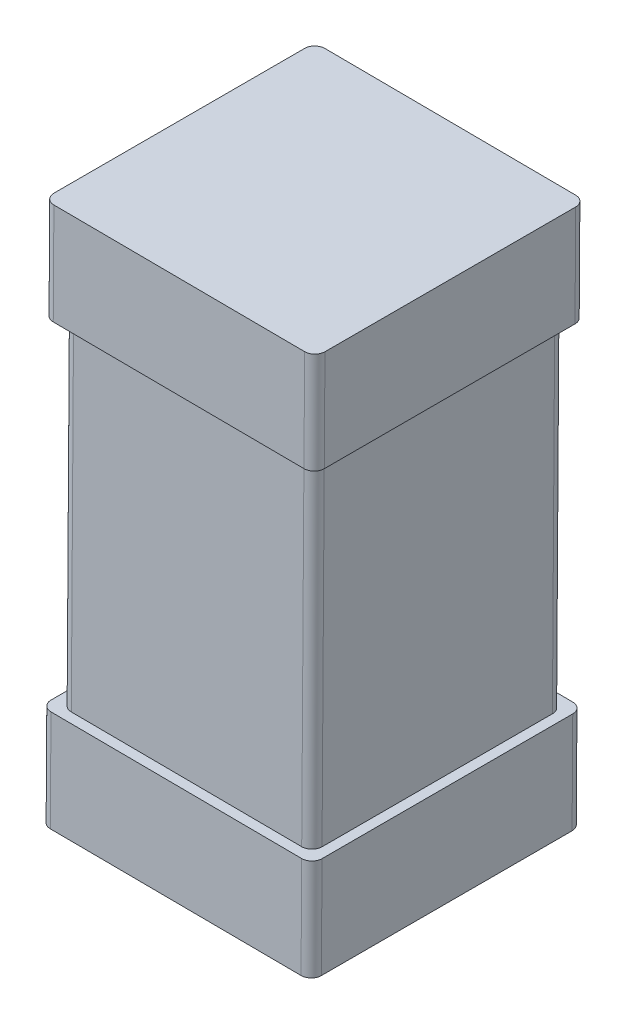
ISO-10303-21;
HEADER;
FILE_DESCRIPTION(('STEP AP214'),'2;1');
FILE_NAME('part.step','',(''),(''),'','','');
FILE_SCHEMA(('AUTOMOTIVE_DESIGN { 1 0 10303 214 1 1 1 1 }'));
ENDSEC;
DATA;
#1=APPLICATION_CONTEXT('core data for automotive mechanical design processes');
#2=APPLICATION_PROTOCOL_DEFINITION('international standard','automotive_design',2000,#1);
#3=PRODUCT_CONTEXT('',#1,'mechanical');
#4=PRODUCT('Part','Part','',(#3));
#5=PRODUCT_RELATED_PRODUCT_CATEGORY('part','',(#4));
#6=PRODUCT_DEFINITION_FORMATION('','',#4);
#7=PRODUCT_DEFINITION_CONTEXT('part definition',#1,'design');
#8=PRODUCT_DEFINITION('design','',#6,#7);
#9=PRODUCT_DEFINITION_SHAPE('','',#8);
#10=(LENGTH_UNIT() NAMED_UNIT(*) SI_UNIT(.MILLI.,.METRE.));
#11=(NAMED_UNIT(*) PLANE_ANGLE_UNIT() SI_UNIT($,.RADIAN.));
#12=(NAMED_UNIT(*) SI_UNIT($,.STERADIAN.) SOLID_ANGLE_UNIT());
#13=UNCERTAINTY_MEASURE_WITH_UNIT(LENGTH_MEASURE(1.E-05),#10,'distance_accuracy_value','');
#14=(GEOMETRIC_REPRESENTATION_CONTEXT(3) GLOBAL_UNCERTAINTY_ASSIGNED_CONTEXT((#13)) GLOBAL_UNIT_ASSIGNED_CONTEXT((#10,
#11,#12)) REPRESENTATION_CONTEXT('',''));
#15=CARTESIAN_POINT('',(0.,0.,0.));
#16=DIRECTION('',(0.,0.,1.));
#17=DIRECTION('',(1.,0.,0.));
#18=AXIS2_PLACEMENT_3D('',#15,#16,#17);
#19=CARTESIAN_POINT('',(219.024368827757,108.484397057099,142.211582908599));
#20=DIRECTION('',(-0.00663069374923689,-0.99997801670857,0.));
#21=DIRECTION('',(-0.99997801670857,0.00663069374923689,0.));
#22=AXIS2_PLACEMENT_3D('',#19,#20,#21);
#23=PLANE('',#22);
#24=DIRECTION('',(0.,0.,1.));
#25=VECTOR('',#24,1.);
#26=CARTESIAN_POINT('',(219.024368827757,108.484397057099,142.211582908599));
#27=LINE('',#26,#25);
#28=CARTESIAN_POINT('',(219.024368827757,108.484397057099,142.241582908599));
#29=VERTEX_POINT('',#28);
#30=CARTESIAN_POINT('',(219.024368827757,108.484397057099,142.981582908599));
#31=VERTEX_POINT('',#30);
#32=EDGE_CURVE('E67',#29,#31,#27,.T.);
#33=ORIENTED_EDGE('',*,*,#32,.F.);
#34=CARTESIAN_POINT('',(219.054368168258,108.484198136286,142.241582908599));
#35=DIRECTION('',(-0.00663069374923689,-0.99997801670857,0.));
#36=DIRECTION('',(0.,0.,1.));
#37=AXIS2_PLACEMENT_3D('',#34,#35,#36);
#38=CIRCLE('',#37,0.0300000000000023);
#39=CARTESIAN_POINT('',(219.054368168258,108.484198136286,142.211582908599));
#40=VERTEX_POINT('',#39);
#41=EDGE_CURVE('E11',#29,#40,#38,.T.);
#42=ORIENTED_EDGE('',*,*,#41,.T.);
#43=DIRECTION('',(0.999978016708569,-0.00663069374923689,0.));
#44=VECTOR('',#43,1.);
#45=CARTESIAN_POINT('',(219.024368827757,108.484397057099,142.211582908599));
#46=LINE('',#45,#44);
#47=CARTESIAN_POINT('',(219.794351900623,108.479291422912,142.211582908599));
#48=VERTEX_POINT('',#47);
#49=EDGE_CURVE('E55',#40,#48,#46,.T.);
#50=ORIENTED_EDGE('',*,*,#49,.T.);
#51=CARTESIAN_POINT('',(219.794351900623,108.479291422912,142.241582908599));
#52=DIRECTION('',(0.00663069374923689,0.99997801670857,0.));
#53=DIRECTION('',(0.,0.,1.));
#54=AXIS2_PLACEMENT_3D('',#51,#52,#53);
#55=CIRCLE('',#54,0.0300000000000023);
#56=CARTESIAN_POINT('',(219.824351241124,108.479092502099,142.241582908599));
#57=VERTEX_POINT('',#56);
#58=EDGE_CURVE('E340',#57,#48,#55,.T.);
#59=ORIENTED_EDGE('',*,*,#58,.F.);
#60=DIRECTION('',(0.,0.,1.));
#61=VECTOR('',#60,1.);
#62=CARTESIAN_POINT('',(219.824351241124,108.479092502099,142.211582908599));
#63=LINE('',#62,#61);
#64=CARTESIAN_POINT('',(219.824351241124,108.479092502099,142.981582908599));
#65=VERTEX_POINT('',#64);
#66=EDGE_CURVE('E418',#57,#65,#63,.T.);
#67=ORIENTED_EDGE('',*,*,#66,.T.);
#68=CARTESIAN_POINT('',(219.794351900623,108.479291422912,142.981582908599));
#69=DIRECTION('',(-0.00663069374923689,-0.99997801670857,0.));
#70=DIRECTION('',(0.,0.,1.));
#71=AXIS2_PLACEMENT_3D('',#68,#69,#70);
#72=CIRCLE('',#71,0.0300000000000023);
#73=CARTESIAN_POINT('',(219.794351900623,108.479291422912,143.011582908599));
#74=VERTEX_POINT('',#73);
#75=EDGE_CURVE('E295',#65,#74,#72,.T.);
#76=ORIENTED_EDGE('',*,*,#75,.T.);
#77=DIRECTION('',(0.999978016708569,-0.00663069374923689,0.));
#78=VECTOR('',#77,1.);
#79=CARTESIAN_POINT('',(219.024368827757,108.484397057099,143.011582908599));
#80=LINE('',#79,#78);
#81=CARTESIAN_POINT('',(219.054368168258,108.484198136286,143.011582908599));
#82=VERTEX_POINT('',#81);
#83=EDGE_CURVE('E297',#82,#74,#80,.T.);
#84=ORIENTED_EDGE('',*,*,#83,.F.);
#85=CARTESIAN_POINT('',(219.054368168258,108.484198136286,142.981582908599));
#86=DIRECTION('',(0.00663069374923689,0.99997801670857,0.));
#87=DIRECTION('',(0.,0.,1.));
#88=AXIS2_PLACEMENT_3D('',#85,#86,#87);
#89=CIRCLE('',#88,0.0300000000000023);
#90=EDGE_CURVE('E410',#31,#82,#89,.T.);
#91=ORIENTED_EDGE('',*,*,#90,.F.);
#92=EDGE_LOOP('',(#33,#42,#50,#59,#67,#76,#84,#91));
#93=FACE_BOUND('',#92,.T.);
#94=ADVANCED_FACE('F44',(#93),#23,.T.);
#95=CARTESIAN_POINT('',(219.826340449249,108.779085907112,142.211582908599));
#96=DIRECTION('',(0.99997801670857,-0.00663069374923689,0.));
#97=DIRECTION('',(0.,0.,-1.));
#98=AXIS2_PLACEMENT_3D('',#95,#96,#97);
#99=PLANE('',#98);
#100=ORIENTED_EDGE('',*,*,#66,.F.);
#101=DIRECTION('',(-0.00663069374923689,-0.999978016708569,0.));
#102=VECTOR('',#101,1.);
#103=CARTESIAN_POINT('',(219.826340449249,108.779085907112,142.241582908599));
#104=LINE('',#103,#102);
#105=CARTESIAN_POINT('',(219.826340449249,108.779085907112,142.241582908599));
#106=VERTEX_POINT('',#105);
#107=EDGE_CURVE('E368',#106,#57,#104,.T.);
#108=ORIENTED_EDGE('',*,*,#107,.F.);
#109=DIRECTION('',(0.,0.,1.));
#110=VECTOR('',#109,1.);
#111=CARTESIAN_POINT('',(219.826340449249,108.779085907112,142.211582908599));
#112=LINE('',#111,#110);
#113=CARTESIAN_POINT('',(219.826340449249,108.779085907112,142.981582908599));
#114=VERTEX_POINT('',#113);
#115=EDGE_CURVE('E291',#106,#114,#112,.T.);
#116=ORIENTED_EDGE('',*,*,#115,.T.);
#117=DIRECTION('',(-0.00663069374923689,-0.999978016708569,0.));
#118=VECTOR('',#117,1.);
#119=CARTESIAN_POINT('',(219.826340449249,108.779085907112,142.981582908599));
#120=LINE('',#119,#118);
#121=EDGE_CURVE('E296',#114,#65,#120,.T.);
#122=ORIENTED_EDGE('',*,*,#121,.T.);
#123=EDGE_LOOP('',(#100,#108,#116,#122));
#124=FACE_BOUND('',#123,.T.);
#125=ADVANCED_FACE('F703',(#124),#99,.T.);
#126=CARTESIAN_POINT('',(219.796341108748,108.779284827924,142.981582908599));
#127=DIRECTION('',(-0.00663069374915559,-0.99997801670857,0.));
#128=DIRECTION('',(0.99997801670857,-0.00663069374915559,0.));
#129=AXIS2_PLACEMENT_3D('',#126,#127,#128);
#130=CYLINDRICAL_SURFACE('',#129,0.0300000000000117);
#131=CARTESIAN_POINT('',(219.796341108748,108.779284827924,142.981582908599));
#132=DIRECTION('',(-0.00663069374923689,-0.99997801670857,0.));
#133=DIRECTION('',(0.,0.,1.));
#134=AXIS2_PLACEMENT_3D('',#131,#132,#133);
#135=CIRCLE('',#134,0.0300000000000023);
#136=CARTESIAN_POINT('',(219.796341108748,108.779284827924,143.011582908599));
#137=VERTEX_POINT('',#136);
#138=EDGE_CURVE('E355',#114,#137,#135,.T.);
#139=ORIENTED_EDGE('',*,*,#138,.T.);
#140=DIRECTION('',(-0.00663069374923689,-0.999978016708569,0.));
#141=VECTOR('',#140,1.);
#142=CARTESIAN_POINT('',(219.796341108748,108.779284827924,143.011582908599));
#143=LINE('',#142,#141);
#144=EDGE_CURVE('E364',#137,#74,#143,.T.);
#145=ORIENTED_EDGE('',*,*,#144,.T.);
#146=ORIENTED_EDGE('',*,*,#75,.F.);
#147=ORIENTED_EDGE('',*,*,#121,.F.);
#148=EDGE_LOOP('',(#139,#145,#146,#147));
#149=FACE_BOUND('',#148,.T.);
#150=ADVANCED_FACE('F397',(#149),#130,.T.);
#151=CARTESIAN_POINT('',(219.796341108748,108.779284827924,142.241582908599));
#152=DIRECTION('',(-0.00663069374915559,-0.99997801670857,0.));
#153=DIRECTION('',(0.99997801670857,-0.00663069374915559,0.));
#154=AXIS2_PLACEMENT_3D('',#151,#152,#153);
#155=CYLINDRICAL_SURFACE('',#154,0.0300000000000117);
#156=ORIENTED_EDGE('',*,*,#107,.T.);
#157=ORIENTED_EDGE('',*,*,#58,.T.);
#158=DIRECTION('',(-0.00663069374923689,-0.999978016708569,0.));
#159=VECTOR('',#158,1.);
#160=CARTESIAN_POINT('',(219.796341108748,108.779284827924,142.211582908599));
#161=LINE('',#160,#159);
#162=CARTESIAN_POINT('',(219.796341108748,108.779284827924,142.211582908599));
#163=VERTEX_POINT('',#162);
#164=EDGE_CURVE('E300',#163,#48,#161,.T.);
#165=ORIENTED_EDGE('',*,*,#164,.F.);
#166=CARTESIAN_POINT('',(219.796341108748,108.779284827924,142.241582908599));
#167=DIRECTION('',(0.00663069374923689,0.99997801670857,0.));
#168=DIRECTION('',(0.,0.,1.));
#169=AXIS2_PLACEMENT_3D('',#166,#167,#168);
#170=CIRCLE('',#169,0.0300000000000023);
#171=EDGE_CURVE('E279',#106,#163,#170,.T.);
#172=ORIENTED_EDGE('',*,*,#171,.F.);
#173=EDGE_LOOP('',(#156,#157,#165,#172));
#174=FACE_BOUND('',#173,.T.);
#175=ADVANCED_FACE('F648',(#174),#155,.T.);
#176=CARTESIAN_POINT('',(219.026358035881,108.784390462111,143.011582908599));
#177=DIRECTION('',(0.,0.,1.));
#178=DIRECTION('',(1.,0.,0.));
#179=AXIS2_PLACEMENT_3D('',#176,#177,#178);
#180=PLANE('',#179);
#181=DIRECTION('',(0.999978016708569,-0.00663069374923689,0.));
#182=VECTOR('',#181,1.);
#183=CARTESIAN_POINT('',(219.026358035881,108.784390462111,143.011582908599));
#184=LINE('',#183,#182);
#185=CARTESIAN_POINT('',(219.056357376383,108.784191541299,143.011582908599));
#186=VERTEX_POINT('',#185);
#187=EDGE_CURVE('E274',#186,#137,#184,.T.);
#188=ORIENTED_EDGE('',*,*,#187,.F.);
#189=DIRECTION('',(-0.00663069374923689,-0.999978016708569,0.));
#190=VECTOR('',#189,1.);
#191=CARTESIAN_POINT('',(219.056357376383,108.784191541299,143.011582908599));
#192=LINE('',#191,#190);
#193=EDGE_CURVE('E299',#186,#82,#192,.T.);
#194=ORIENTED_EDGE('',*,*,#193,.T.);
#195=ORIENTED_EDGE('',*,*,#83,.T.);
#196=ORIENTED_EDGE('',*,*,#144,.F.);
#197=EDGE_LOOP('',(#188,#194,#195,#196));
#198=FACE_BOUND('',#197,.T.);
#199=ADVANCED_FACE('F405',(#198),#180,.T.);
#200=CARTESIAN_POINT('',(219.026358035881,108.784390462111,142.211582908599));
#201=DIRECTION('',(0.,0.,1.));
#202=DIRECTION('',(1.,0.,0.));
#203=AXIS2_PLACEMENT_3D('',#200,#201,#202);
#204=PLANE('',#203);
#205=ORIENTED_EDGE('',*,*,#164,.T.);
#206=ORIENTED_EDGE('',*,*,#49,.F.);
#207=DIRECTION('',(-0.00663069374923689,-0.999978016708569,0.));
#208=VECTOR('',#207,1.);
#209=CARTESIAN_POINT('',(219.056357376383,108.784191541299,142.211582908599));
#210=LINE('',#209,#208);
#211=CARTESIAN_POINT('',(219.056357376383,108.784191541299,142.211582908599));
#212=VERTEX_POINT('',#211);
#213=EDGE_CURVE('E313',#212,#40,#210,.T.);
#214=ORIENTED_EDGE('',*,*,#213,.F.);
#215=DIRECTION('',(0.999978016708569,-0.00663069374923689,0.));
#216=VECTOR('',#215,1.);
#217=CARTESIAN_POINT('',(219.026358035881,108.784390462111,142.211582908599));
#218=LINE('',#217,#216);
#219=EDGE_CURVE('E358',#212,#163,#218,.T.);
#220=ORIENTED_EDGE('',*,*,#219,.T.);
#221=EDGE_LOOP('',(#205,#206,#214,#220));
#222=FACE_BOUND('',#221,.T.);
#223=ADVANCED_FACE('F581',(#222),#204,.F.);
#224=CARTESIAN_POINT('',(219.056357376383,108.784191541299,142.981582908599));
#225=DIRECTION('',(-0.00663069374915559,-0.99997801670857,0.));
#226=DIRECTION('',(-0.99997801670857,0.00663069374915559,0.));
#227=AXIS2_PLACEMENT_3D('',#224,#225,#226);
#228=CYLINDRICAL_SURFACE('',#227,0.0300000000000117);
#229=DIRECTION('',(-0.00663069374923689,-0.999978016708569,0.));
#230=VECTOR('',#229,1.);
#231=CARTESIAN_POINT('',(219.026358035881,108.784390462111,142.981582908599));
#232=LINE('',#231,#230);
#233=CARTESIAN_POINT('',(219.026358035881,108.784390462111,142.981582908599));
#234=VERTEX_POINT('',#233);
#235=EDGE_CURVE('E412',#234,#31,#232,.T.);
#236=ORIENTED_EDGE('',*,*,#235,.T.);
#237=ORIENTED_EDGE('',*,*,#90,.T.);
#238=ORIENTED_EDGE('',*,*,#193,.F.);
#239=CARTESIAN_POINT('',(219.056357376383,108.784191541299,142.981582908599));
#240=DIRECTION('',(0.00663069374923689,0.99997801670857,0.));
#241=DIRECTION('',(0.,0.,1.));
#242=AXIS2_PLACEMENT_3D('',#239,#240,#241);
#243=CIRCLE('',#242,0.0300000000000023);
#244=EDGE_CURVE('E278',#234,#186,#243,.T.);
#245=ORIENTED_EDGE('',*,*,#244,.F.);
#246=EDGE_LOOP('',(#236,#237,#238,#245));
#247=FACE_BOUND('',#246,.T.);
#248=ADVANCED_FACE('F408',(#247),#228,.T.);
#249=CARTESIAN_POINT('',(219.056357376383,108.784191541299,142.241582908599));
#250=DIRECTION('',(-0.00663069374915559,-0.99997801670857,0.));
#251=DIRECTION('',(-0.99997801670857,0.00663069374915559,0.));
#252=AXIS2_PLACEMENT_3D('',#249,#250,#251);
#253=CYLINDRICAL_SURFACE('',#252,0.0300000000000117);
#254=CARTESIAN_POINT('',(219.056357376383,108.784191541299,142.241582908599));
#255=DIRECTION('',(-0.00663069374923689,-0.99997801670857,0.));
#256=DIRECTION('',(0.,0.,1.));
#257=AXIS2_PLACEMENT_3D('',#254,#255,#256);
#258=CIRCLE('',#257,0.0300000000000023);
#259=CARTESIAN_POINT('',(219.026358035881,108.784390462111,142.241582908599));
#260=VERTEX_POINT('',#259);
#261=EDGE_CURVE('E317',#260,#212,#258,.T.);
#262=ORIENTED_EDGE('',*,*,#261,.T.);
#263=ORIENTED_EDGE('',*,*,#213,.T.);
#264=ORIENTED_EDGE('',*,*,#41,.F.);
#265=DIRECTION('',(-0.00663069374923689,-0.999978016708569,0.));
#266=VECTOR('',#265,1.);
#267=CARTESIAN_POINT('',(219.026358035881,108.784390462111,142.241582908599));
#268=LINE('',#267,#266);
#269=EDGE_CURVE('E318',#260,#29,#268,.T.);
#270=ORIENTED_EDGE('',*,*,#269,.F.);
#271=EDGE_LOOP('',(#262,#263,#264,#270));
#272=FACE_BOUND('',#271,.T.);
#273=ADVANCED_FACE('F580',(#272),#253,.T.);
#274=CARTESIAN_POINT('',(219.026358035881,108.784390462111,142.211582908599));
#275=DIRECTION('',(0.99997801670857,-0.00663069374923689,0.));
#276=DIRECTION('',(0.,0.,-1.));
#277=AXIS2_PLACEMENT_3D('',#274,#275,#276);
#278=PLANE('',#277);
#279=ORIENTED_EDGE('',*,*,#235,.F.);
#280=DIRECTION('',(0.,0.,1.));
#281=VECTOR('',#280,1.);
#282=CARTESIAN_POINT('',(219.026358035881,108.784390462111,142.211582908599));
#283=LINE('',#282,#281);
#284=EDGE_CURVE('E341',#260,#234,#283,.T.);
#285=ORIENTED_EDGE('',*,*,#284,.F.);
#286=ORIENTED_EDGE('',*,*,#269,.T.);
#287=ORIENTED_EDGE('',*,*,#32,.T.);
#288=EDGE_LOOP('',(#279,#285,#286,#287));
#289=FACE_BOUND('',#288,.T.);
#290=ADVANCED_FACE('F752',(#289),#278,.F.);
#291=CARTESIAN_POINT('',(219.026358035881,108.784390462111,142.211582908599));
#292=DIRECTION('',(-0.00663069374923689,-0.99997801670857,0.));
#293=DIRECTION('',(-0.99997801670857,0.00663069374923689,0.));
#294=AXIS2_PLACEMENT_3D('',#291,#292,#293);
#295=PLANE('',#294);
#296=ORIENTED_EDGE('',*,*,#244,.T.);
#297=ORIENTED_EDGE('',*,*,#187,.T.);
#298=ORIENTED_EDGE('',*,*,#138,.F.);
#299=ORIENTED_EDGE('',*,*,#115,.F.);
#300=ORIENTED_EDGE('',*,*,#171,.T.);
#301=ORIENTED_EDGE('',*,*,#219,.F.);
#302=ORIENTED_EDGE('',*,*,#261,.F.);
#303=ORIENTED_EDGE('',*,*,#284,.T.);
#304=EDGE_LOOP('',(#296,#297,#298,#299,#300,#301,#302,#303));
#305=FACE_BOUND('',#304,.T.);
#306=DIRECTION('',(0.999978016708569,-0.00663069374923689,0.));
#307=VECTOR('',#306,1.);
#308=CARTESIAN_POINT('',(219.056357376383,108.784191541299,142.241582908599));
#309=LINE('',#308,#307);
#310=CARTESIAN_POINT('',(219.086356716884,108.783992620486,142.241582908599));
#311=VERTEX_POINT('',#310);
#312=CARTESIAN_POINT('',(219.766341768246,108.779483748737,142.241582908599));
#313=VERTEX_POINT('',#312);
#314=EDGE_CURVE('E345',#311,#313,#309,.T.);
#315=ORIENTED_EDGE('',*,*,#314,.T.);
#316=CARTESIAN_POINT('',(219.766341768246,108.779483748737,142.271582908599));
#317=DIRECTION('',(0.00663069374923689,0.99997801670857,0.));
#318=DIRECTION('',(0.,0.,1.));
#319=AXIS2_PLACEMENT_3D('',#316,#317,#318);
#320=CIRCLE('',#319,0.0300000000000023);
#321=CARTESIAN_POINT('',(219.796341108748,108.779284827924,142.271582908599));
#322=VERTEX_POINT('',#321);
#323=EDGE_CURVE('E241',#322,#313,#320,.T.);
#324=ORIENTED_EDGE('',*,*,#323,.F.);
#325=DIRECTION('',(0.,0.,1.));
#326=VECTOR('',#325,1.);
#327=CARTESIAN_POINT('',(219.796341108748,108.779284827924,142.241582908599));
#328=LINE('',#327,#326);
#329=CARTESIAN_POINT('',(219.796341108748,108.779284827924,142.951582908599));
#330=VERTEX_POINT('',#329);
#331=EDGE_CURVE('E236',#322,#330,#328,.T.);
#332=ORIENTED_EDGE('',*,*,#331,.T.);
#333=CARTESIAN_POINT('',(219.766341768246,108.779483748737,142.951582908599));
#334=DIRECTION('',(-0.00663069374923689,-0.99997801670857,0.));
#335=DIRECTION('',(0.,0.,1.));
#336=AXIS2_PLACEMENT_3D('',#333,#334,#335);
#337=CIRCLE('',#336,0.0300000000000023);
#338=CARTESIAN_POINT('',(219.766341768246,108.779483748737,142.981582908599));
#339=VERTEX_POINT('',#338);
#340=EDGE_CURVE('E464',#330,#339,#337,.T.);
#341=ORIENTED_EDGE('',*,*,#340,.T.);
#342=DIRECTION('',(0.999978016708569,-0.00663069374923689,0.));
#343=VECTOR('',#342,1.);
#344=CARTESIAN_POINT('',(219.056357376383,108.784191541299,142.981582908599));
#345=LINE('',#344,#343);
#346=CARTESIAN_POINT('',(219.086356716884,108.783992620486,142.981582908599));
#347=VERTEX_POINT('',#346);
#348=EDGE_CURVE('E312',#347,#339,#345,.T.);
#349=ORIENTED_EDGE('',*,*,#348,.F.);
#350=CARTESIAN_POINT('',(219.086356716884,108.783992620486,142.951582908599));
#351=DIRECTION('',(0.00663069374923689,0.99997801670857,0.));
#352=DIRECTION('',(0.,0.,1.));
#353=AXIS2_PLACEMENT_3D('',#350,#351,#352);
#354=CIRCLE('',#353,0.0300000000000023);
#355=CARTESIAN_POINT('',(219.056357376383,108.784191541299,142.951582908599));
#356=VERTEX_POINT('',#355);
#357=EDGE_CURVE('E311',#356,#347,#354,.T.);
#358=ORIENTED_EDGE('',*,*,#357,.F.);
#359=DIRECTION('',(0.,0.,1.));
#360=VECTOR('',#359,1.);
#361=CARTESIAN_POINT('',(219.056357376383,108.784191541299,142.241582908599));
#362=LINE('',#361,#360);
#363=CARTESIAN_POINT('',(219.056357376383,108.784191541299,142.271582908599));
#364=VERTEX_POINT('',#363);
#365=EDGE_CURVE('E445',#364,#356,#362,.T.);
#366=ORIENTED_EDGE('',*,*,#365,.F.);
#367=CARTESIAN_POINT('',(219.086356716884,108.783992620486,142.271582908599));
#368=DIRECTION('',(-0.00663069374923689,-0.99997801670857,0.));
#369=DIRECTION('',(0.,0.,1.));
#370=AXIS2_PLACEMENT_3D('',#367,#368,#369);
#371=CIRCLE('',#370,0.0300000000000023);
#372=EDGE_CURVE('E457',#364,#311,#371,.T.);
#373=ORIENTED_EDGE('',*,*,#372,.T.);
#374=EDGE_LOOP('',(#315,#324,#332,#341,#349,#358,#366,#373));
#375=FACE_BOUND('',#374,.T.);
#376=ADVANCED_FACE('F401',(#305,#375),#295,.F.);
#377=CARTESIAN_POINT('',(219.062988070132,109.784169558007,142.241582908599));
#378=DIRECTION('',(0.99997801670857,-0.00663069374923689,0.));
#379=DIRECTION('',(0.,0.,-1.));
#380=AXIS2_PLACEMENT_3D('',#377,#378,#379);
#381=PLANE('',#380);
#382=DIRECTION('',(-0.00663069374923689,-0.999978016708569,0.));
#383=VECTOR('',#382,1.);
#384=CARTESIAN_POINT('',(219.062988070132,109.784169558007,142.951582908599));
#385=LINE('',#384,#383);
#386=CARTESIAN_POINT('',(219.062988070132,109.784169558007,142.951582908599));
#387=VERTEX_POINT('',#386);
#388=EDGE_CURVE('E441',#387,#356,#385,.T.);
#389=ORIENTED_EDGE('',*,*,#388,.F.);
#390=DIRECTION('',(0.,0.,1.));
#391=VECTOR('',#390,1.);
#392=CARTESIAN_POINT('',(219.062988070132,109.784169558007,142.241582908599));
#393=LINE('',#392,#391);
#394=CARTESIAN_POINT('',(219.062988070132,109.784169558007,142.271582908599));
#395=VERTEX_POINT('',#394);
#396=EDGE_CURVE('E374',#395,#387,#393,.T.);
#397=ORIENTED_EDGE('',*,*,#396,.F.);
#398=DIRECTION('',(-0.00663069374923689,-0.999978016708569,0.));
#399=VECTOR('',#398,1.);
#400=CARTESIAN_POINT('',(219.062988070132,109.784169558007,142.271582908599));
#401=LINE('',#400,#399);
#402=EDGE_CURVE('E449',#395,#364,#401,.T.);
#403=ORIENTED_EDGE('',*,*,#402,.T.);
#404=ORIENTED_EDGE('',*,*,#365,.T.);
#405=EDGE_LOOP('',(#389,#397,#403,#404));
#406=FACE_BOUND('',#405,.T.);
#407=ADVANCED_FACE('F518',(#406),#381,.F.);
#408=CARTESIAN_POINT('',(219.092987410633,109.783970637195,142.951582908599));
#409=DIRECTION('',(-0.00663069374915559,-0.99997801670857,0.));
#410=DIRECTION('',(-0.99997801670857,0.00663069374915559,0.));
#411=AXIS2_PLACEMENT_3D('',#408,#409,#410);
#412=CYLINDRICAL_SURFACE('',#411,0.0300000000000117);
#413=ORIENTED_EDGE('',*,*,#388,.T.);
#414=ORIENTED_EDGE('',*,*,#357,.T.);
#415=DIRECTION('',(-0.00663069374923689,-0.999978016708569,0.));
#416=VECTOR('',#415,1.);
#417=CARTESIAN_POINT('',(219.092987410633,109.783970637195,142.981582908599));
#418=LINE('',#417,#416);
#419=CARTESIAN_POINT('',(219.092987410633,109.783970637195,142.981582908599));
#420=VERTEX_POINT('',#419);
#421=EDGE_CURVE('E307',#420,#347,#418,.T.);
#422=ORIENTED_EDGE('',*,*,#421,.F.);
#423=CARTESIAN_POINT('',(219.092987410633,109.783970637195,142.951582908599));
#424=DIRECTION('',(0.00663069374923689,0.99997801670857,0.));
#425=DIRECTION('',(0.,0.,1.));
#426=AXIS2_PLACEMENT_3D('',#423,#424,#425);
#427=CIRCLE('',#426,0.0300000000000023);
#428=EDGE_CURVE('E265',#387,#420,#427,.T.);
#429=ORIENTED_EDGE('',*,*,#428,.F.);
#430=EDGE_LOOP('',(#413,#414,#422,#429));
#431=FACE_BOUND('',#430,.T.);
#432=ADVANCED_FACE('F509',(#431),#412,.T.);
#433=CARTESIAN_POINT('',(219.062988070132,109.784169558007,142.981582908599));
#434=DIRECTION('',(0.,0.,1.));
#435=DIRECTION('',(1.,0.,0.));
#436=AXIS2_PLACEMENT_3D('',#433,#434,#435);
#437=PLANE('',#436);
#438=DIRECTION('',(0.999978016708569,-0.00663069374923689,0.));
#439=VECTOR('',#438,1.);
#440=CARTESIAN_POINT('',(219.062988070132,109.784169558007,142.981582908599));
#441=LINE('',#440,#439);
#442=CARTESIAN_POINT('',(219.772972461995,109.779461765445,142.981582908599));
#443=VERTEX_POINT('',#442);
#444=EDGE_CURVE('E259',#420,#443,#441,.T.);
#445=ORIENTED_EDGE('',*,*,#444,.F.);
#446=ORIENTED_EDGE('',*,*,#421,.T.);
#447=ORIENTED_EDGE('',*,*,#348,.T.);
#448=DIRECTION('',(-0.00663069374923689,-0.999978016708569,0.));
#449=VECTOR('',#448,1.);
#450=CARTESIAN_POINT('',(219.772972461995,109.779461765445,142.981582908599));
#451=LINE('',#450,#449);
#452=EDGE_CURVE('E252',#443,#339,#451,.T.);
#453=ORIENTED_EDGE('',*,*,#452,.F.);
#454=EDGE_LOOP('',(#445,#446,#447,#453));
#455=FACE_BOUND('',#454,.T.);
#456=ADVANCED_FACE('F514',(#455),#437,.T.);
#457=CARTESIAN_POINT('',(219.772972461995,109.779461765445,142.951582908599));
#458=DIRECTION('',(-0.00663069374915559,-0.99997801670857,0.));
#459=DIRECTION('',(0.99997801670857,-0.00663069374915559,0.));
#460=AXIS2_PLACEMENT_3D('',#457,#458,#459);
#461=CYLINDRICAL_SURFACE('',#460,0.0300000000000117);
#462=CARTESIAN_POINT('',(219.772972461995,109.779461765445,142.951582908599));
#463=DIRECTION('',(-0.00663069374923689,-0.99997801670857,0.));
#464=DIRECTION('',(0.,0.,1.));
#465=AXIS2_PLACEMENT_3D('',#462,#463,#464);
#466=CIRCLE('',#465,0.0300000000000023);
#467=CARTESIAN_POINT('',(219.802971802497,109.779262844633,142.951582908599));
#468=VERTEX_POINT('',#467);
#469=EDGE_CURVE('E48',#468,#443,#466,.T.);
#470=ORIENTED_EDGE('',*,*,#469,.T.);
#471=ORIENTED_EDGE('',*,*,#452,.T.);
#472=ORIENTED_EDGE('',*,*,#340,.F.);
#473=DIRECTION('',(-0.00663069374923689,-0.999978016708569,0.));
#474=VECTOR('',#473,1.);
#475=CARTESIAN_POINT('',(219.802971802497,109.779262844633,142.951582908599));
#476=LINE('',#475,#474);
#477=EDGE_CURVE('E240',#468,#330,#476,.T.);
#478=ORIENTED_EDGE('',*,*,#477,.F.);
#479=EDGE_LOOP('',(#470,#471,#472,#478));
#480=FACE_BOUND('',#479,.T.);
#481=ADVANCED_FACE('F570',(#480),#461,.T.);
#482=CARTESIAN_POINT('',(219.802971802497,109.779262844633,142.241582908599));
#483=DIRECTION('',(0.99997801670857,-0.00663069374923689,0.));
#484=DIRECTION('',(0.,0.,-1.));
#485=AXIS2_PLACEMENT_3D('',#482,#483,#484);
#486=PLANE('',#485);
#487=ORIENTED_EDGE('',*,*,#331,.F.);
#488=DIRECTION('',(-0.00663069374923689,-0.999978016708569,0.));
#489=VECTOR('',#488,1.);
#490=CARTESIAN_POINT('',(219.802971802497,109.779262844633,142.271582908599));
#491=LINE('',#490,#489);
#492=CARTESIAN_POINT('',(219.802971802497,109.779262844633,142.271582908599));
#493=VERTEX_POINT('',#492);
#494=EDGE_CURVE('E230',#493,#322,#491,.T.);
#495=ORIENTED_EDGE('',*,*,#494,.F.);
#496=DIRECTION('',(0.,0.,1.));
#497=VECTOR('',#496,1.);
#498=CARTESIAN_POINT('',(219.802971802497,109.779262844633,142.241582908599));
#499=LINE('',#498,#497);
#500=EDGE_CURVE('E234',#493,#468,#499,.T.);
#501=ORIENTED_EDGE('',*,*,#500,.T.);
#502=ORIENTED_EDGE('',*,*,#477,.T.);
#503=EDGE_LOOP('',(#487,#495,#501,#502));
#504=FACE_BOUND('',#503,.T.);
#505=ADVANCED_FACE('F232',(#504),#486,.T.);
#506=CARTESIAN_POINT('',(219.772972461995,109.779461765445,142.271582908599));
#507=DIRECTION('',(-0.00663069374915559,-0.99997801670857,0.));
#508=DIRECTION('',(0.99997801670857,-0.00663069374915559,0.));
#509=AXIS2_PLACEMENT_3D('',#506,#507,#508);
#510=CYLINDRICAL_SURFACE('',#509,0.0300000000000117);
#511=ORIENTED_EDGE('',*,*,#494,.T.);
#512=ORIENTED_EDGE('',*,*,#323,.T.);
#513=DIRECTION('',(-0.00663069374923689,-0.999978016708569,0.));
#514=VECTOR('',#513,1.);
#515=CARTESIAN_POINT('',(219.772972461995,109.779461765445,142.241582908599));
#516=LINE('',#515,#514);
#517=CARTESIAN_POINT('',(219.772972461995,109.779461765445,142.241582908599));
#518=VERTEX_POINT('',#517);
#519=EDGE_CURVE('E256',#518,#313,#516,.T.);
#520=ORIENTED_EDGE('',*,*,#519,.F.);
#521=CARTESIAN_POINT('',(219.772972461995,109.779461765445,142.271582908599));
#522=DIRECTION('',(0.00663069374923689,0.99997801670857,0.));
#523=DIRECTION('',(0.,0.,1.));
#524=AXIS2_PLACEMENT_3D('',#521,#522,#523);
#525=CIRCLE('',#524,0.0300000000000023);
#526=EDGE_CURVE('E248',#493,#518,#525,.T.);
#527=ORIENTED_EDGE('',*,*,#526,.F.);
#528=EDGE_LOOP('',(#511,#512,#520,#527));
#529=FACE_BOUND('',#528,.T.);
#530=ADVANCED_FACE('F254',(#529),#510,.T.);
#531=CARTESIAN_POINT('',(219.062988070132,109.784169558007,142.241582908599));
#532=DIRECTION('',(0.,0.,1.));
#533=DIRECTION('',(1.,0.,0.));
#534=AXIS2_PLACEMENT_3D('',#531,#532,#533);
#535=PLANE('',#534);
#536=ORIENTED_EDGE('',*,*,#519,.T.);
#537=ORIENTED_EDGE('',*,*,#314,.F.);
#538=DIRECTION('',(-0.00663069374923689,-0.999978016708569,0.));
#539=VECTOR('',#538,1.);
#540=CARTESIAN_POINT('',(219.092987410633,109.783970637195,142.241582908599));
#541=LINE('',#540,#539);
#542=CARTESIAN_POINT('',(219.092987410633,109.783970637195,142.241582908599));
#543=VERTEX_POINT('',#542);
#544=EDGE_CURVE('E331',#543,#311,#541,.T.);
#545=ORIENTED_EDGE('',*,*,#544,.F.);
#546=DIRECTION('',(0.999978016708569,-0.00663069374923689,0.));
#547=VECTOR('',#546,1.);
#548=CARTESIAN_POINT('',(219.062988070132,109.784169558007,142.241582908599));
#549=LINE('',#548,#547);
#550=EDGE_CURVE('E360',#543,#518,#549,.T.);
#551=ORIENTED_EDGE('',*,*,#550,.T.);
#552=EDGE_LOOP('',(#536,#537,#545,#551));
#553=FACE_BOUND('',#552,.T.);
#554=ADVANCED_FACE('F523',(#553),#535,.F.);
#555=CARTESIAN_POINT('',(219.092987410633,109.783970637195,142.271582908599));
#556=DIRECTION('',(-0.00663069374915559,-0.99997801670857,0.));
#557=DIRECTION('',(-0.99997801670857,0.00663069374915559,0.));
#558=AXIS2_PLACEMENT_3D('',#555,#556,#557);
#559=CYLINDRICAL_SURFACE('',#558,0.0300000000000117);
#560=CARTESIAN_POINT('',(219.092987410633,109.783970637195,142.271582908599));
#561=DIRECTION('',(-0.00663069374923689,-0.99997801670857,0.));
#562=DIRECTION('',(0.,0.,1.));
#563=AXIS2_PLACEMENT_3D('',#560,#561,#562);
#564=CIRCLE('',#563,0.0300000000000023);
#565=EDGE_CURVE('E363',#395,#543,#564,.T.);
#566=ORIENTED_EDGE('',*,*,#565,.T.);
#567=ORIENTED_EDGE('',*,*,#544,.T.);
#568=ORIENTED_EDGE('',*,*,#372,.F.);
#569=ORIENTED_EDGE('',*,*,#402,.F.);
#570=EDGE_LOOP('',(#566,#567,#568,#569));
#571=FACE_BOUND('',#570,.T.);
#572=ADVANCED_FACE('F46',(#571),#559,.T.);
#573=CARTESIAN_POINT('',(219.032988729631,109.78436847882,142.211582908599));
#574=DIRECTION('',(-0.00663069374923689,-0.99997801670857,0.));
#575=DIRECTION('',(-0.99997801670857,0.00663069374923689,0.));
#576=AXIS2_PLACEMENT_3D('',#573,#574,#575);
#577=PLANE('',#576);
#578=DIRECTION('',(0.,0.,1.));
#579=VECTOR('',#578,1.);
#580=CARTESIAN_POINT('',(219.032988729631,109.78436847882,142.211582908599));
#581=LINE('',#580,#579);
#582=CARTESIAN_POINT('',(219.032988729631,109.78436847882,142.241582908599));
#583=VERTEX_POINT('',#582);
#584=CARTESIAN_POINT('',(219.032988729631,109.78436847882,142.981582908599));
#585=VERTEX_POINT('',#584);
#586=EDGE_CURVE('E375',#583,#585,#581,.T.);
#587=ORIENTED_EDGE('',*,*,#586,.F.);
#588=CARTESIAN_POINT('',(219.062988070132,109.784169558007,142.241582908599));
#589=DIRECTION('',(-0.00663069374923689,-0.99997801670857,0.));
#590=DIRECTION('',(0.,0.,1.));
#591=AXIS2_PLACEMENT_3D('',#588,#589,#590);
#592=CIRCLE('',#591,0.0300000000000023);
#593=CARTESIAN_POINT('',(219.062988070132,109.784169558007,142.211582908599));
#594=VERTEX_POINT('',#593);
#595=EDGE_CURVE('E327',#583,#594,#592,.T.);
#596=ORIENTED_EDGE('',*,*,#595,.T.);
#597=DIRECTION('',(0.999978016708569,-0.00663069374923689,0.));
#598=VECTOR('',#597,1.);
#599=CARTESIAN_POINT('',(219.032988729631,109.78436847882,142.211582908599));
#600=LINE('',#599,#598);
#601=CARTESIAN_POINT('',(219.802971802497,109.779262844633,142.211582908599));
#602=VERTEX_POINT('',#601);
#603=EDGE_CURVE('E332',#594,#602,#600,.T.);
#604=ORIENTED_EDGE('',*,*,#603,.T.);
#605=CARTESIAN_POINT('',(219.802971802497,109.779262844633,142.241582908599));
#606=DIRECTION('',(0.00663069374923689,0.99997801670857,0.));
#607=DIRECTION('',(0.,0.,1.));
#608=AXIS2_PLACEMENT_3D('',#605,#606,#607);
#609=CIRCLE('',#608,0.0300000000000023);
#610=CARTESIAN_POINT('',(219.832971142997,109.77906392382,142.241582908599));
#611=VERTEX_POINT('',#610);
#612=EDGE_CURVE('E323',#611,#602,#609,.T.);
#613=ORIENTED_EDGE('',*,*,#612,.F.);
#614=DIRECTION('',(0.,0.,1.));
#615=VECTOR('',#614,1.);
#616=CARTESIAN_POINT('',(219.832971142997,109.77906392382,142.211582908599));
#617=LINE('',#616,#615);
#618=CARTESIAN_POINT('',(219.832971142997,109.77906392382,142.981582908599));
#619=VERTEX_POINT('',#618);
#620=EDGE_CURVE('E373',#611,#619,#617,.T.);
#621=ORIENTED_EDGE('',*,*,#620,.T.);
#622=CARTESIAN_POINT('',(219.802971802497,109.779262844633,142.981582908599));
#623=DIRECTION('',(-0.00663069374923689,-0.99997801670857,0.));
#624=DIRECTION('',(0.,0.,1.));
#625=AXIS2_PLACEMENT_3D('',#622,#623,#624);
#626=CIRCLE('',#625,0.0300000000000023);
#627=CARTESIAN_POINT('',(219.802971802497,109.779262844633,143.011582908599));
#628=VERTEX_POINT('',#627);
#629=EDGE_CURVE('E369',#619,#628,#626,.T.);
#630=ORIENTED_EDGE('',*,*,#629,.T.);
#631=DIRECTION('',(0.999978016708569,-0.00663069374923689,0.));
#632=VECTOR('',#631,1.);
#633=CARTESIAN_POINT('',(219.032988729631,109.78436847882,143.011582908599));
#634=LINE('',#633,#632);
#635=CARTESIAN_POINT('',(219.062988070132,109.784169558007,143.011582908599));
#636=VERTEX_POINT('',#635);
#637=EDGE_CURVE('E324',#636,#628,#634,.T.);
#638=ORIENTED_EDGE('',*,*,#637,.F.);
#639=CARTESIAN_POINT('',(219.062988070132,109.784169558007,142.981582908599));
#640=DIRECTION('',(0.00663069374923689,0.99997801670857,0.));
#641=DIRECTION('',(0.,0.,1.));
#642=AXIS2_PLACEMENT_3D('',#639,#640,#641);
#643=CIRCLE('',#642,0.0300000000000023);
#644=EDGE_CURVE('E289',#585,#636,#643,.T.);
#645=ORIENTED_EDGE('',*,*,#644,.F.);
#646=EDGE_LOOP('',(#587,#596,#604,#613,#621,#630,#638,#645));
#647=FACE_BOUND('',#646,.T.);
#648=ORIENTED_EDGE('',*,*,#565,.F.);
#649=ORIENTED_EDGE('',*,*,#396,.T.);
#650=ORIENTED_EDGE('',*,*,#428,.T.);
#651=ORIENTED_EDGE('',*,*,#444,.T.);
#652=ORIENTED_EDGE('',*,*,#469,.F.);
#653=ORIENTED_EDGE('',*,*,#500,.F.);
#654=ORIENTED_EDGE('',*,*,#526,.T.);
#655=ORIENTED_EDGE('',*,*,#550,.F.);
#656=EDGE_LOOP('',(#648,#649,#650,#651,#652,#653,#654,#655));
#657=FACE_BOUND('',#656,.T.);
#658=ADVANCED_FACE('F246',(#647,#657),#577,.T.);
#659=CARTESIAN_POINT('',(219.834960351122,110.079057328833,142.211582908599));
#660=DIRECTION('',(0.99997801670857,-0.00663069374923689,0.));
#661=DIRECTION('',(0.,0.,-1.));
#662=AXIS2_PLACEMENT_3D('',#659,#660,#661);
#663=PLANE('',#662);
#664=ORIENTED_EDGE('',*,*,#620,.F.);
#665=DIRECTION('',(-0.00663069374923689,-0.999978016708569,0.));
#666=VECTOR('',#665,1.);
#667=CARTESIAN_POINT('',(219.834960351122,110.079057328833,142.241582908599));
#668=LINE('',#667,#666);
#669=CARTESIAN_POINT('',(219.834960351122,110.079057328833,142.241582908599));
#670=VERTEX_POINT('',#669);
#671=EDGE_CURVE('E348',#670,#611,#668,.T.);
#672=ORIENTED_EDGE('',*,*,#671,.F.);
#673=DIRECTION('',(0.,0.,1.));
#674=VECTOR('',#673,1.);
#675=CARTESIAN_POINT('',(219.834960351122,110.079057328833,142.211582908599));
#676=LINE('',#675,#674);
#677=CARTESIAN_POINT('',(219.834960351122,110.079057328833,142.981582908599));
#678=VERTEX_POINT('',#677);
#679=EDGE_CURVE('E260',#670,#678,#676,.T.);
#680=ORIENTED_EDGE('',*,*,#679,.T.);
#681=DIRECTION('',(-0.00663069374923689,-0.999978016708569,0.));
#682=VECTOR('',#681,1.);
#683=CARTESIAN_POINT('',(219.834960351122,110.079057328833,142.981582908599));
#684=LINE('',#683,#682);
#685=EDGE_CURVE('E269',#678,#619,#684,.T.);
#686=ORIENTED_EDGE('',*,*,#685,.T.);
#687=EDGE_LOOP('',(#664,#672,#680,#686));
#688=FACE_BOUND('',#687,.T.);
#689=ADVANCED_FACE('F592',(#688),#663,.T.);
#690=CARTESIAN_POINT('',(219.804961010621,110.079256249646,142.981582908599));
#691=DIRECTION('',(-0.00663069374915559,-0.99997801670857,0.));
#692=DIRECTION('',(0.99997801670857,-0.00663069374915559,0.));
#693=AXIS2_PLACEMENT_3D('',#690,#691,#692);
#694=CYLINDRICAL_SURFACE('',#693,0.0300000000000117);
#695=CARTESIAN_POINT('',(219.804961010621,110.079256249646,142.981582908599));
#696=DIRECTION('',(-0.00663069374923689,-0.99997801670857,0.));
#697=DIRECTION('',(0.,0.,1.));
#698=AXIS2_PLACEMENT_3D('',#695,#696,#697);
#699=CIRCLE('',#698,0.0300000000000023);
#700=CARTESIAN_POINT('',(219.804961010621,110.079256249646,143.011582908599));
#701=VERTEX_POINT('',#700);
#702=EDGE_CURVE('E302',#678,#701,#699,.T.);
#703=ORIENTED_EDGE('',*,*,#702,.T.);
#704=DIRECTION('',(-0.00663069374923689,-0.999978016708569,0.));
#705=VECTOR('',#704,1.);
#706=CARTESIAN_POINT('',(219.804961010621,110.079256249646,143.011582908599));
#707=LINE('',#706,#705);
#708=EDGE_CURVE('E306',#701,#628,#707,.T.);
#709=ORIENTED_EDGE('',*,*,#708,.T.);
#710=ORIENTED_EDGE('',*,*,#629,.F.);
#711=ORIENTED_EDGE('',*,*,#685,.F.);
#712=EDGE_LOOP('',(#703,#709,#710,#711));
#713=FACE_BOUND('',#712,.T.);
#714=ADVANCED_FACE('F625',(#713),#694,.T.);
#715=CARTESIAN_POINT('',(219.804961010621,110.079256249646,142.241582908599));
#716=DIRECTION('',(-0.00663069374915559,-0.99997801670857,0.));
#717=DIRECTION('',(0.99997801670857,-0.00663069374915559,0.));
#718=AXIS2_PLACEMENT_3D('',#715,#716,#717);
#719=CYLINDRICAL_SURFACE('',#718,0.0300000000000117);
#720=ORIENTED_EDGE('',*,*,#671,.T.);
#721=ORIENTED_EDGE('',*,*,#612,.T.);
#722=DIRECTION('',(-0.00663069374923689,-0.999978016708569,0.));
#723=VECTOR('',#722,1.);
#724=CARTESIAN_POINT('',(219.804961010621,110.079256249646,142.211582908599));
#725=LINE('',#724,#723);
#726=CARTESIAN_POINT('',(219.804961010621,110.079256249646,142.211582908599));
#727=VERTEX_POINT('',#726);
#728=EDGE_CURVE('E430',#727,#602,#725,.T.);
#729=ORIENTED_EDGE('',*,*,#728,.F.);
#730=CARTESIAN_POINT('',(219.804961010621,110.079256249646,142.241582908599));
#731=DIRECTION('',(0.00663069374923689,0.99997801670857,0.));
#732=DIRECTION('',(0.,0.,1.));
#733=AXIS2_PLACEMENT_3D('',#730,#731,#732);
#734=CIRCLE('',#733,0.0300000000000023);
#735=EDGE_CURVE('E284',#670,#727,#734,.T.);
#736=ORIENTED_EDGE('',*,*,#735,.F.);
#737=EDGE_LOOP('',(#720,#721,#729,#736));
#738=FACE_BOUND('',#737,.T.);
#739=ADVANCED_FACE('F629',(#738),#719,.T.);
#740=CARTESIAN_POINT('',(219.034977937756,110.084361883832,143.011582908599));
#741=DIRECTION('',(0.,0.,1.));
#742=DIRECTION('',(1.,0.,0.));
#743=AXIS2_PLACEMENT_3D('',#740,#741,#742);
#744=PLANE('',#743);
#745=DIRECTION('',(0.999978016708569,-0.00663069374923689,0.));
#746=VECTOR('',#745,1.);
#747=CARTESIAN_POINT('',(219.034977937756,110.084361883832,143.011582908599));
#748=LINE('',#747,#746);
#749=CARTESIAN_POINT('',(219.064977278257,110.08416296302,143.011582908599));
#750=VERTEX_POINT('',#749);
#751=EDGE_CURVE('E385',#750,#701,#748,.T.);
#752=ORIENTED_EDGE('',*,*,#751,.F.);
#753=DIRECTION('',(-0.00663069374923689,-0.999978016708569,0.));
#754=VECTOR('',#753,1.);
#755=CARTESIAN_POINT('',(219.064977278257,110.08416296302,143.011582908599));
#756=LINE('',#755,#754);
#757=EDGE_CURVE('E319',#750,#636,#756,.T.);
#758=ORIENTED_EDGE('',*,*,#757,.T.);
#759=ORIENTED_EDGE('',*,*,#637,.T.);
#760=ORIENTED_EDGE('',*,*,#708,.F.);
#761=EDGE_LOOP('',(#752,#758,#759,#760));
#762=FACE_BOUND('',#761,.T.);
#763=ADVANCED_FACE('F740',(#762),#744,.T.);
#764=CARTESIAN_POINT('',(219.034977937756,110.084361883832,142.211582908599));
#765=DIRECTION('',(0.,0.,1.));
#766=DIRECTION('',(1.,0.,0.));
#767=AXIS2_PLACEMENT_3D('',#764,#765,#766);
#768=PLANE('',#767);
#769=ORIENTED_EDGE('',*,*,#728,.T.);
#770=ORIENTED_EDGE('',*,*,#603,.F.);
#771=DIRECTION('',(-0.00663069374923689,-0.999978016708569,0.));
#772=VECTOR('',#771,1.);
#773=CARTESIAN_POINT('',(219.064977278257,110.08416296302,142.211582908599));
#774=LINE('',#773,#772);
#775=CARTESIAN_POINT('',(219.064977278257,110.08416296302,142.211582908599));
#776=VERTEX_POINT('',#775);
#777=EDGE_CURVE('E290',#776,#594,#774,.T.);
#778=ORIENTED_EDGE('',*,*,#777,.F.);
#779=DIRECTION('',(0.999978016708569,-0.00663069374923689,0.));
#780=VECTOR('',#779,1.);
#781=CARTESIAN_POINT('',(219.034977937756,110.084361883832,142.211582908599));
#782=LINE('',#781,#780);
#783=EDGE_CURVE('E434',#776,#727,#782,.T.);
#784=ORIENTED_EDGE('',*,*,#783,.T.);
#785=EDGE_LOOP('',(#769,#770,#778,#784));
#786=FACE_BOUND('',#785,.T.);
#787=ADVANCED_FACE('F795',(#786),#768,.F.);
#788=CARTESIAN_POINT('',(219.064977278257,110.08416296302,142.981582908599));
#789=DIRECTION('',(-0.00663069374915559,-0.99997801670857,0.));
#790=DIRECTION('',(-0.99997801670857,0.00663069374915559,0.));
#791=AXIS2_PLACEMENT_3D('',#788,#789,#790);
#792=CYLINDRICAL_SURFACE('',#791,0.0300000000000117);
#793=DIRECTION('',(-0.00663069374923689,-0.999978016708569,0.));
#794=VECTOR('',#793,1.);
#795=CARTESIAN_POINT('',(219.034977937756,110.084361883832,142.981582908599));
#796=LINE('',#795,#794);
#797=CARTESIAN_POINT('',(219.034977937756,110.084361883832,142.981582908599));
#798=VERTEX_POINT('',#797);
#799=EDGE_CURVE('E388',#798,#585,#796,.T.);
#800=ORIENTED_EDGE('',*,*,#799,.T.);
#801=ORIENTED_EDGE('',*,*,#644,.T.);
#802=ORIENTED_EDGE('',*,*,#757,.F.);
#803=CARTESIAN_POINT('',(219.064977278257,110.08416296302,142.981582908599));
#804=DIRECTION('',(0.00663069374923689,0.99997801670857,0.));
#805=DIRECTION('',(0.,0.,1.));
#806=AXIS2_PLACEMENT_3D('',#803,#804,#805);
#807=CIRCLE('',#806,0.0300000000000023);
#808=EDGE_CURVE('E378',#798,#750,#807,.T.);
#809=ORIENTED_EDGE('',*,*,#808,.F.);
#810=EDGE_LOOP('',(#800,#801,#802,#809));
#811=FACE_BOUND('',#810,.T.);
#812=ADVANCED_FACE('F616',(#811),#792,.T.);
#813=CARTESIAN_POINT('',(219.064977278257,110.08416296302,142.241582908599));
#814=DIRECTION('',(-0.00663069374915559,-0.99997801670857,0.));
#815=DIRECTION('',(-0.99997801670857,0.00663069374915559,0.));
#816=AXIS2_PLACEMENT_3D('',#813,#814,#815);
#817=CYLINDRICAL_SURFACE('',#816,0.0300000000000117);
#818=CARTESIAN_POINT('',(219.064977278257,110.08416296302,142.241582908599));
#819=DIRECTION('',(-0.00663069374923689,-0.99997801670857,0.));
#820=DIRECTION('',(0.,0.,1.));
#821=AXIS2_PLACEMENT_3D('',#818,#819,#820);
#822=CIRCLE('',#821,0.0300000000000023);
#823=CARTESIAN_POINT('',(219.034977937756,110.084361883832,142.241582908599));
#824=VERTEX_POINT('',#823);
#825=EDGE_CURVE('E285',#824,#776,#822,.T.);
#826=ORIENTED_EDGE('',*,*,#825,.T.);
#827=ORIENTED_EDGE('',*,*,#777,.T.);
#828=ORIENTED_EDGE('',*,*,#595,.F.);
#829=DIRECTION('',(-0.00663069374923689,-0.999978016708569,0.));
#830=VECTOR('',#829,1.);
#831=CARTESIAN_POINT('',(219.034977937756,110.084361883832,142.241582908599));
#832=LINE('',#831,#830);
#833=EDGE_CURVE('E336',#824,#583,#832,.T.);
#834=ORIENTED_EDGE('',*,*,#833,.F.);
#835=EDGE_LOOP('',(#826,#827,#828,#834));
#836=FACE_BOUND('',#835,.T.);
#837=ADVANCED_FACE('F611',(#836),#817,.T.);
#838=CARTESIAN_POINT('',(219.034977937756,110.084361883832,142.211582908599));
#839=DIRECTION('',(0.99997801670857,-0.00663069374923689,0.));
#840=DIRECTION('',(0.,0.,-1.));
#841=AXIS2_PLACEMENT_3D('',#838,#839,#840);
#842=PLANE('',#841);
#843=ORIENTED_EDGE('',*,*,#799,.F.);
#844=DIRECTION('',(0.,0.,1.));
#845=VECTOR('',#844,1.);
#846=CARTESIAN_POINT('',(219.034977937756,110.084361883832,142.211582908599));
#847=LINE('',#846,#845);
#848=EDGE_CURVE('E280',#824,#798,#847,.T.);
#849=ORIENTED_EDGE('',*,*,#848,.F.);
#850=ORIENTED_EDGE('',*,*,#833,.T.);
#851=ORIENTED_EDGE('',*,*,#586,.T.);
#852=EDGE_LOOP('',(#843,#849,#850,#851));
#853=FACE_BOUND('',#852,.T.);
#854=ADVANCED_FACE('F615',(#853),#842,.F.);
#855=CARTESIAN_POINT('',(219.034977937756,110.084361883832,142.211582908599));
#856=DIRECTION('',(-0.00663069374923689,-0.99997801670857,0.));
#857=DIRECTION('',(-0.99997801670857,0.00663069374923689,0.));
#858=AXIS2_PLACEMENT_3D('',#855,#856,#857);
#859=PLANE('',#858);
#860=ORIENTED_EDGE('',*,*,#808,.T.);
#861=ORIENTED_EDGE('',*,*,#751,.T.);
#862=ORIENTED_EDGE('',*,*,#702,.F.);
#863=ORIENTED_EDGE('',*,*,#679,.F.);
#864=ORIENTED_EDGE('',*,*,#735,.T.);
#865=ORIENTED_EDGE('',*,*,#783,.F.);
#866=ORIENTED_EDGE('',*,*,#825,.F.);
#867=ORIENTED_EDGE('',*,*,#848,.T.);
#868=EDGE_LOOP('',(#860,#861,#862,#863,#864,#865,#866,#867));
#869=FACE_BOUND('',#868,.T.);
#870=ADVANCED_FACE('F670',(#869),#859,.F.);
#871=CLOSED_SHELL('',(#94,#125,#150,#175,#199,#223,#248,#273,#290,#376,#407,#432,#456,#481,#505,
#530,#554,#572,#658,#689,#714,#739,#763,#787,#812,#837,#854,#870));
#872=MANIFOLD_SOLID_BREP('B2',#871);
#873=ADVANCED_BREP_SHAPE_REPRESENTATION('',(#18,#872),#14);
#874=SHAPE_DEFINITION_REPRESENTATION(#9,#873);
ENDSEC;
END-ISO-10303-21;
